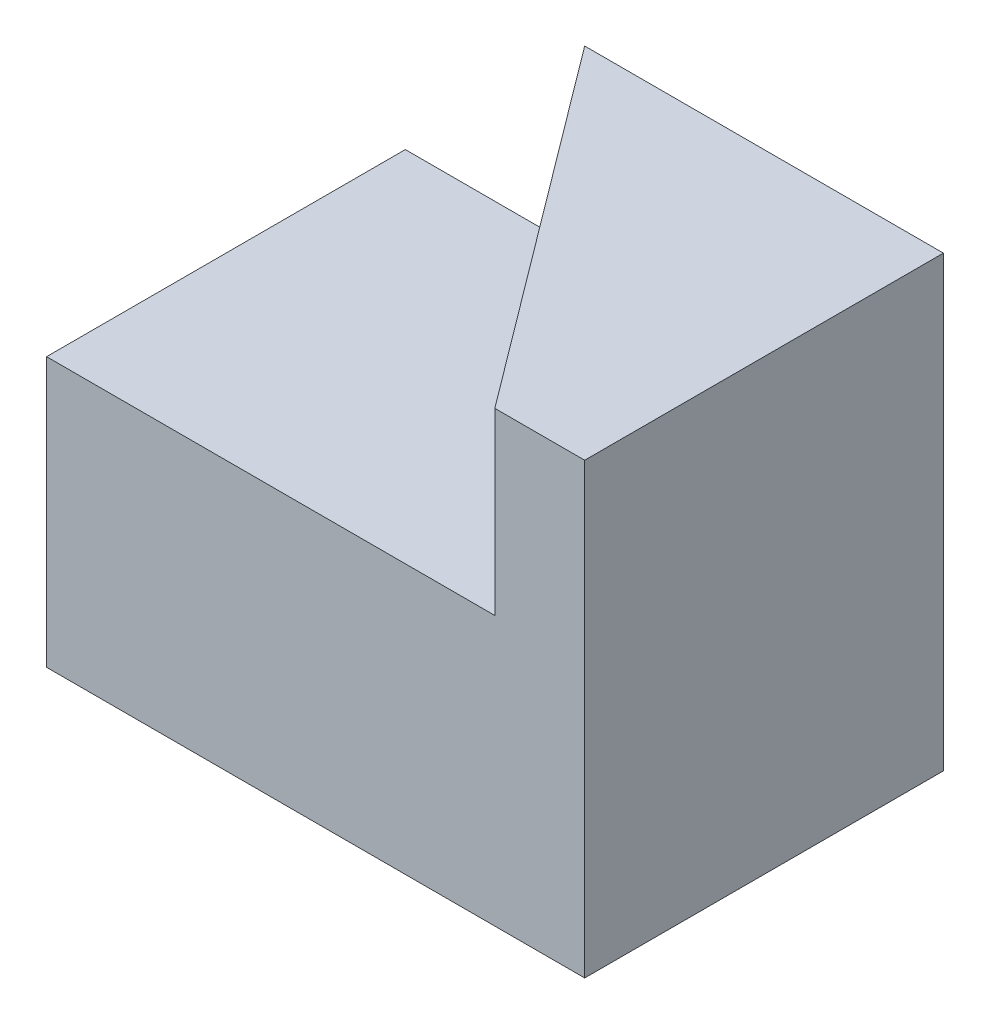
ISO-10303-21;
HEADER;
FILE_DESCRIPTION(('STEP AP214'),'2;1');
FILE_NAME('part.step','',(''),(''),'','','');
FILE_SCHEMA(('AUTOMOTIVE_DESIGN { 1 0 10303 214 1 1 1 1 }'));
ENDSEC;
DATA;
#1=APPLICATION_CONTEXT('core data for automotive mechanical design processes');
#2=APPLICATION_PROTOCOL_DEFINITION('international standard','automotive_design',2000,#1);
#3=PRODUCT_CONTEXT('',#1,'mechanical');
#4=PRODUCT('Part','Part','',(#3));
#5=PRODUCT_RELATED_PRODUCT_CATEGORY('part','',(#4));
#6=PRODUCT_DEFINITION_FORMATION('','',#4);
#7=PRODUCT_DEFINITION_CONTEXT('part definition',#1,'design');
#8=PRODUCT_DEFINITION('design','',#6,#7);
#9=PRODUCT_DEFINITION_SHAPE('','',#8);
#10=(LENGTH_UNIT() NAMED_UNIT(*) SI_UNIT(.MILLI.,.METRE.));
#11=(NAMED_UNIT(*) PLANE_ANGLE_UNIT() SI_UNIT($,.RADIAN.));
#12=(NAMED_UNIT(*) SI_UNIT($,.STERADIAN.) SOLID_ANGLE_UNIT());
#13=UNCERTAINTY_MEASURE_WITH_UNIT(LENGTH_MEASURE(1.E-05),#10,'distance_accuracy_value','');
#14=(GEOMETRIC_REPRESENTATION_CONTEXT(3) GLOBAL_UNCERTAINTY_ASSIGNED_CONTEXT((#13)) GLOBAL_UNIT_ASSIGNED_CONTEXT((#10,
#11,#12)) REPRESENTATION_CONTEXT('',''));
#15=CARTESIAN_POINT('',(0.,0.,0.));
#16=DIRECTION('',(0.,0.,1.));
#17=DIRECTION('',(1.,0.,0.));
#18=AXIS2_PLACEMENT_3D('',#15,#16,#17);
#19=CARTESIAN_POINT('',(0.,3.,0.));
#20=DIRECTION('',(0.,-1.,0.));
#21=DIRECTION('',(0.,0.,-1.));
#22=AXIS2_PLACEMENT_3D('',#19,#20,#21);
#23=PLANE('',#22);
#24=DIRECTION('',(0.599725213969995,0.,0.800206015803833));
#25=VECTOR('',#24,1.);
#26=CARTESIAN_POINT('',(4.99785406320672,3.,0.));
#27=LINE('',#26,#25);
#28=CARTESIAN_POINT('',(2.,3.,-4.));
#29=VERTEX_POINT('',#28);
#30=CARTESIAN_POINT('',(4.99785406320672,3.,0.));
#31=VERTEX_POINT('',#30);
#32=EDGE_CURVE('E52',#29,#31,#27,.T.);
#33=ORIENTED_EDGE('',*,*,#32,.F.);
#34=DIRECTION('',(-1.,0.,0.));
#35=VECTOR('',#34,1.);
#36=CARTESIAN_POINT('',(0.,3.,-4.));
#37=LINE('',#36,#35);
#38=CARTESIAN_POINT('',(0.,3.,-4.));
#39=VERTEX_POINT('',#38);
#40=EDGE_CURVE('E57',#29,#39,#37,.T.);
#41=ORIENTED_EDGE('',*,*,#40,.T.);
#42=DIRECTION('',(0.,0.,1.));
#43=VECTOR('',#42,1.);
#44=CARTESIAN_POINT('',(0.,3.,0.));
#45=LINE('',#44,#43);
#46=CARTESIAN_POINT('',(0.,3.,0.));
#47=VERTEX_POINT('',#46);
#48=EDGE_CURVE('E88',#39,#47,#45,.T.);
#49=ORIENTED_EDGE('',*,*,#48,.T.);
#50=DIRECTION('',(1.,0.,0.));
#51=VECTOR('',#50,1.);
#52=CARTESIAN_POINT('',(0.,3.,0.));
#53=LINE('',#52,#51);
#54=EDGE_CURVE('E111',#47,#31,#53,.T.);
#55=ORIENTED_EDGE('',*,*,#54,.T.);
#56=EDGE_LOOP('',(#33,#41,#49,#55));
#57=FACE_BOUND('',#56,.T.);
#58=ADVANCED_FACE('F35',(#57),#23,.F.);
#59=CARTESIAN_POINT('',(0.,3.,0.));
#60=DIRECTION('',(1.,0.,0.));
#61=DIRECTION('',(0.,0.,-1.));
#62=AXIS2_PLACEMENT_3D('',#59,#60,#61);
#63=PLANE('',#62);
#64=DIRECTION('',(0.,0.,1.));
#65=VECTOR('',#64,1.);
#66=CARTESIAN_POINT('',(0.,0.,0.));
#67=LINE('',#66,#65);
#68=CARTESIAN_POINT('',(0.,0.,-4.));
#69=VERTEX_POINT('',#68);
#70=CARTESIAN_POINT('',(0.,0.,0.));
#71=VERTEX_POINT('',#70);
#72=EDGE_CURVE('E94',#69,#71,#67,.T.);
#73=ORIENTED_EDGE('',*,*,#72,.T.);
#74=DIRECTION('',(0.,-1.,0.));
#75=VECTOR('',#74,1.);
#76=CARTESIAN_POINT('',(0.,3.,0.));
#77=LINE('',#76,#75);
#78=EDGE_CURVE('E11',#47,#71,#77,.T.);
#79=ORIENTED_EDGE('',*,*,#78,.F.);
#80=ORIENTED_EDGE('',*,*,#48,.F.);
#81=DIRECTION('',(0.,-1.,0.));
#82=VECTOR('',#81,1.);
#83=CARTESIAN_POINT('',(0.,3.,-4.));
#84=LINE('',#83,#82);
#85=EDGE_CURVE('E80',#39,#69,#84,.T.);
#86=ORIENTED_EDGE('',*,*,#85,.T.);
#87=EDGE_LOOP('',(#73,#79,#80,#86));
#88=FACE_BOUND('',#87,.T.);
#89=ADVANCED_FACE('F37',(#88),#63,.F.);
#90=CARTESIAN_POINT('',(0.,3.,0.));
#91=DIRECTION('',(0.,0.,-1.));
#92=DIRECTION('',(-1.,0.,0.));
#93=AXIS2_PLACEMENT_3D('',#90,#91,#92);
#94=PLANE('',#93);
#95=DIRECTION('',(1.,0.,0.));
#96=VECTOR('',#95,1.);
#97=CARTESIAN_POINT('',(0.,0.,0.));
#98=LINE('',#97,#96);
#99=CARTESIAN_POINT('',(6.,0.,0.));
#100=VERTEX_POINT('',#99);
#101=EDGE_CURVE('E97',#71,#100,#98,.T.);
#102=ORIENTED_EDGE('',*,*,#101,.T.);
#103=DIRECTION('',(0.,-1.,0.));
#104=VECTOR('',#103,1.);
#105=CARTESIAN_POINT('',(6.,3.,0.));
#106=LINE('',#105,#104);
#107=CARTESIAN_POINT('',(6.,5.,0.));
#108=VERTEX_POINT('',#107);
#109=EDGE_CURVE('E44',#108,#100,#106,.T.);
#110=ORIENTED_EDGE('',*,*,#109,.F.);
#111=DIRECTION('',(1.,0.,0.));
#112=VECTOR('',#111,1.);
#113=CARTESIAN_POINT('',(6.,5.,0.));
#114=LINE('',#113,#112);
#115=CARTESIAN_POINT('',(4.99785406320672,5.,0.));
#116=VERTEX_POINT('',#115);
#117=EDGE_CURVE('E131',#116,#108,#114,.T.);
#118=ORIENTED_EDGE('',*,*,#117,.F.);
#119=DIRECTION('',(0.,-1.,0.));
#120=VECTOR('',#119,1.);
#121=CARTESIAN_POINT('',(4.99785406320672,5.,0.));
#122=LINE('',#121,#120);
#123=EDGE_CURVE('E102',#116,#31,#122,.T.);
#124=ORIENTED_EDGE('',*,*,#123,.T.);
#125=ORIENTED_EDGE('',*,*,#54,.F.);
#126=ORIENTED_EDGE('',*,*,#78,.T.);
#127=EDGE_LOOP('',(#102,#110,#118,#124,#125,#126));
#128=FACE_BOUND('',#127,.T.);
#129=ADVANCED_FACE('F151',(#128),#94,.F.);
#130=CARTESIAN_POINT('',(6.,3.,0.));
#131=DIRECTION('',(-1.,0.,0.));
#132=DIRECTION('',(0.,0.,1.));
#133=AXIS2_PLACEMENT_3D('',#130,#131,#132);
#134=PLANE('',#133);
#135=DIRECTION('',(0.,0.,-1.));
#136=VECTOR('',#135,1.);
#137=CARTESIAN_POINT('',(6.,0.,0.));
#138=LINE('',#137,#136);
#139=CARTESIAN_POINT('',(6.,0.,-4.));
#140=VERTEX_POINT('',#139);
#141=EDGE_CURVE('E89',#100,#140,#138,.T.);
#142=ORIENTED_EDGE('',*,*,#141,.T.);
#143=DIRECTION('',(0.,-1.,0.));
#144=VECTOR('',#143,1.);
#145=CARTESIAN_POINT('',(6.,3.,-4.));
#146=LINE('',#145,#144);
#147=CARTESIAN_POINT('',(6.,5.,-4.));
#148=VERTEX_POINT('',#147);
#149=EDGE_CURVE('E84',#148,#140,#146,.T.);
#150=ORIENTED_EDGE('',*,*,#149,.F.);
#151=DIRECTION('',(0.,0.,-1.));
#152=VECTOR('',#151,1.);
#153=CARTESIAN_POINT('',(6.,5.,-4.));
#154=LINE('',#153,#152);
#155=EDGE_CURVE('E119',#108,#148,#154,.T.);
#156=ORIENTED_EDGE('',*,*,#155,.F.);
#157=ORIENTED_EDGE('',*,*,#109,.T.);
#158=EDGE_LOOP('',(#142,#150,#156,#157));
#159=FACE_BOUND('',#158,.T.);
#160=ADVANCED_FACE('F154',(#159),#134,.F.);
#161=CARTESIAN_POINT('',(0.,3.,-4.));
#162=DIRECTION('',(0.,0.,1.));
#163=DIRECTION('',(1.,0.,0.));
#164=AXIS2_PLACEMENT_3D('',#161,#162,#163);
#165=PLANE('',#164);
#166=DIRECTION('',(-1.,0.,0.));
#167=VECTOR('',#166,1.);
#168=CARTESIAN_POINT('',(0.,0.,-4.));
#169=LINE('',#168,#167);
#170=EDGE_CURVE('E77',#140,#69,#169,.T.);
#171=ORIENTED_EDGE('',*,*,#170,.T.);
#172=ORIENTED_EDGE('',*,*,#85,.F.);
#173=ORIENTED_EDGE('',*,*,#40,.F.);
#174=DIRECTION('',(0.,-1.,0.));
#175=VECTOR('',#174,1.);
#176=CARTESIAN_POINT('',(2.,5.,-4.));
#177=LINE('',#176,#175);
#178=CARTESIAN_POINT('',(2.,5.,-4.));
#179=VERTEX_POINT('',#178);
#180=EDGE_CURVE('E98',#179,#29,#177,.T.);
#181=ORIENTED_EDGE('',*,*,#180,.F.);
#182=DIRECTION('',(-1.,0.,0.));
#183=VECTOR('',#182,1.);
#184=CARTESIAN_POINT('',(2.,5.,-4.));
#185=LINE('',#184,#183);
#186=EDGE_CURVE('E122',#148,#179,#185,.T.);
#187=ORIENTED_EDGE('',*,*,#186,.F.);
#188=ORIENTED_EDGE('',*,*,#149,.T.);
#189=EDGE_LOOP('',(#171,#172,#173,#181,#187,#188));
#190=FACE_BOUND('',#189,.T.);
#191=ADVANCED_FACE('F79',(#190),#165,.F.);
#192=CARTESIAN_POINT('',(0.,0.,0.));
#193=DIRECTION('',(0.,-1.,0.));
#194=DIRECTION('',(0.,0.,-1.));
#195=AXIS2_PLACEMENT_3D('',#192,#193,#194);
#196=PLANE('',#195);
#197=ORIENTED_EDGE('',*,*,#72,.F.);
#198=ORIENTED_EDGE('',*,*,#170,.F.);
#199=ORIENTED_EDGE('',*,*,#141,.F.);
#200=ORIENTED_EDGE('',*,*,#101,.F.);
#201=EDGE_LOOP('',(#197,#198,#199,#200));
#202=FACE_BOUND('',#201,.T.);
#203=ADVANCED_FACE('F96',(#202),#196,.T.);
#204=CARTESIAN_POINT('',(4.99785406320672,5.,0.));
#205=DIRECTION('',(0.800206015803833,0.,-0.599725213969995));
#206=DIRECTION('',(-0.599725213969995,0.,-0.800206015803833));
#207=AXIS2_PLACEMENT_3D('',#204,#205,#206);
#208=PLANE('',#207);
#209=ORIENTED_EDGE('',*,*,#32,.T.);
#210=ORIENTED_EDGE('',*,*,#123,.F.);
#211=DIRECTION('',(0.599725213969995,0.,0.800206015803833));
#212=VECTOR('',#211,1.);
#213=CARTESIAN_POINT('',(4.99785406320672,5.,0.));
#214=LINE('',#213,#212);
#215=EDGE_CURVE('E136',#179,#116,#214,.T.);
#216=ORIENTED_EDGE('',*,*,#215,.F.);
#217=ORIENTED_EDGE('',*,*,#180,.T.);
#218=EDGE_LOOP('',(#209,#210,#216,#217));
#219=FACE_BOUND('',#218,.T.);
#220=ADVANCED_FACE('F148',(#219),#208,.F.);
#221=CARTESIAN_POINT('',(0.,5.,0.));
#222=DIRECTION('',(0.,-1.,0.));
#223=DIRECTION('',(0.,0.,-1.));
#224=AXIS2_PLACEMENT_3D('',#221,#222,#223);
#225=PLANE('',#224);
#226=ORIENTED_EDGE('',*,*,#186,.T.);
#227=ORIENTED_EDGE('',*,*,#215,.T.);
#228=ORIENTED_EDGE('',*,*,#117,.T.);
#229=ORIENTED_EDGE('',*,*,#155,.T.);
#230=EDGE_LOOP('',(#226,#227,#228,#229));
#231=FACE_BOUND('',#230,.T.);
#232=ADVANCED_FACE('F143',(#231),#225,.F.);
#233=CLOSED_SHELL('',(#58,#89,#129,#160,#191,#203,#220,#232));
#234=MANIFOLD_SOLID_BREP('B2',#233);
#235=ADVANCED_BREP_SHAPE_REPRESENTATION('',(#18,#234),#14);
#236=SHAPE_DEFINITION_REPRESENTATION(#9,#235);
ENDSEC;
END-ISO-10303-21;
